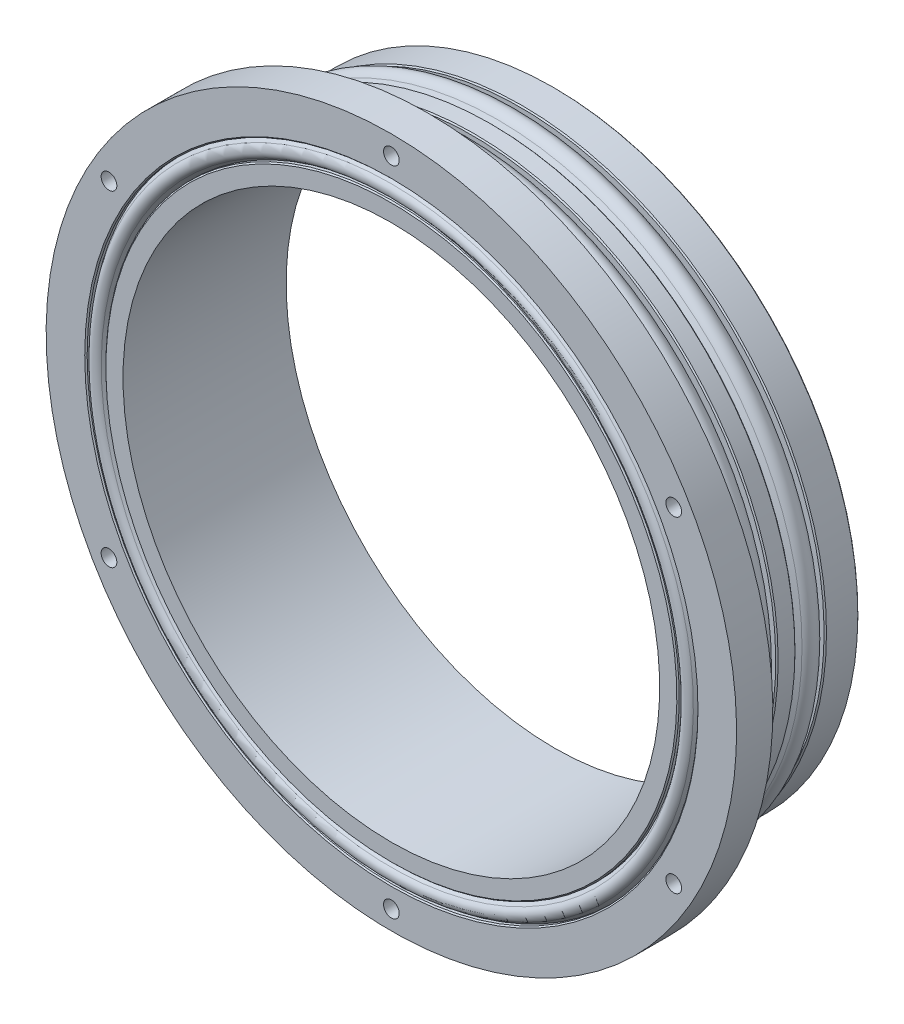
ISO-10303-21;
HEADER;
FILE_DESCRIPTION(('STEP AP214'),'2;1');
FILE_NAME('part.step','',(''),(''),'','','');
FILE_SCHEMA(('AUTOMOTIVE_DESIGN { 1 0 10303 214 1 1 1 1 }'));
ENDSEC;
DATA;
#1=APPLICATION_CONTEXT('core data for automotive mechanical design processes');
#2=APPLICATION_PROTOCOL_DEFINITION('international standard','automotive_design',2000,#1);
#3=PRODUCT_CONTEXT('',#1,'mechanical');
#4=PRODUCT('Part','Part','',(#3));
#5=PRODUCT_RELATED_PRODUCT_CATEGORY('part','',(#4));
#6=PRODUCT_DEFINITION_FORMATION('','',#4);
#7=PRODUCT_DEFINITION_CONTEXT('part definition',#1,'design');
#8=PRODUCT_DEFINITION('design','',#6,#7);
#9=PRODUCT_DEFINITION_SHAPE('','',#8);
#10=(LENGTH_UNIT() NAMED_UNIT(*) SI_UNIT(.MILLI.,.METRE.));
#11=(NAMED_UNIT(*) PLANE_ANGLE_UNIT() SI_UNIT($,.RADIAN.));
#12=(NAMED_UNIT(*) SI_UNIT($,.STERADIAN.) SOLID_ANGLE_UNIT());
#13=UNCERTAINTY_MEASURE_WITH_UNIT(LENGTH_MEASURE(1.E-05),#10,'distance_accuracy_value','');
#14=(GEOMETRIC_REPRESENTATION_CONTEXT(3) GLOBAL_UNCERTAINTY_ASSIGNED_CONTEXT((#13)) GLOBAL_UNIT_ASSIGNED_CONTEXT((#10,
#11,#12)) REPRESENTATION_CONTEXT('',''));
#15=CARTESIAN_POINT('',(0.,0.,0.));
#16=DIRECTION('',(0.,0.,1.));
#17=DIRECTION('',(1.,0.,0.));
#18=AXIS2_PLACEMENT_3D('',#15,#16,#17);
#19=CARTESIAN_POINT('',(0.,44.419,0.));
#20=DIRECTION('',(0.,0.,-1.));
#21=DIRECTION('',(0.,1.,0.));
#22=AXIS2_PLACEMENT_3D('',#19,#20,#21);
#23=PLANE('',#22);
#24=CARTESIAN_POINT('',(0.,-46.99,0.));
#25=DIRECTION('',(0.,0.,-1.));
#26=DIRECTION('',(0.,1.,0.));
#27=AXIS2_PLACEMENT_3D('',#24,#25,#26);
#28=CIRCLE('',#27,1.3);
#29=CARTESIAN_POINT('',(0.,-45.69,0.));
#30=VERTEX_POINT('',#29);
#31=EDGE_CURVE('E186',#30,#30,#28,.T.);
#32=ORIENTED_EDGE('',*,*,#31,.F.);
#33=EDGE_LOOP('',(#32));
#34=FACE_BOUND('',#33,.T.);
#35=CARTESIAN_POINT('',(-46.99,0.,0.));
#36=DIRECTION('',(0.,0.,-1.));
#37=DIRECTION('',(0.,1.,0.));
#38=AXIS2_PLACEMENT_3D('',#35,#36,#37);
#39=CIRCLE('',#38,1.3);
#40=CARTESIAN_POINT('',(-46.99,1.3,0.));
#41=VERTEX_POINT('',#40);
#42=EDGE_CURVE('E180',#41,#41,#39,.T.);
#43=ORIENTED_EDGE('',*,*,#42,.F.);
#44=EDGE_LOOP('',(#43));
#45=FACE_BOUND('',#44,.T.);
#46=CARTESIAN_POINT('',(0.,46.99,0.));
#47=DIRECTION('',(0.,0.,-1.));
#48=DIRECTION('',(0.,1.,0.));
#49=AXIS2_PLACEMENT_3D('',#46,#47,#48);
#50=CIRCLE('',#49,1.3);
#51=CARTESIAN_POINT('',(0.,48.29,0.));
#52=VERTEX_POINT('',#51);
#53=EDGE_CURVE('E174',#52,#52,#50,.T.);
#54=ORIENTED_EDGE('',*,*,#53,.F.);
#55=EDGE_LOOP('',(#54));
#56=FACE_BOUND('',#55,.T.);
#57=CARTESIAN_POINT('',(46.99,0.,0.));
#58=DIRECTION('',(0.,0.,-1.));
#59=DIRECTION('',(0.,1.,0.));
#60=AXIS2_PLACEMENT_3D('',#57,#58,#59);
#61=CIRCLE('',#60,1.3);
#62=CARTESIAN_POINT('',(46.99,1.3,0.));
#63=VERTEX_POINT('',#62);
#64=EDGE_CURVE('E168',#63,#63,#61,.T.);
#65=ORIENTED_EDGE('',*,*,#64,.F.);
#66=EDGE_LOOP('',(#65));
#67=FACE_BOUND('',#66,.T.);
#68=CARTESIAN_POINT('',(0.,0.,0.));
#69=DIRECTION('',(0.,0.,-1.));
#70=DIRECTION('',(0.,1.,0.));
#71=AXIS2_PLACEMENT_3D('',#68,#69,#70);
#72=CIRCLE('',#71,50.219);
#73=CARTESIAN_POINT('',(0.,50.219,0.));
#74=VERTEX_POINT('',#73);
#75=EDGE_CURVE('E65',#74,#74,#72,.T.);
#76=ORIENTED_EDGE('',*,*,#75,.T.);
#77=EDGE_LOOP('',(#76));
#78=FACE_BOUND('',#77,.T.);
#79=CARTESIAN_POINT('',(0.,0.,0.));
#80=DIRECTION('',(0.,0.,-1.));
#81=DIRECTION('',(0.,1.,0.));
#82=AXIS2_PLACEMENT_3D('',#79,#80,#81);
#83=CIRCLE('',#82,44.419);
#84=CARTESIAN_POINT('',(0.,44.419,0.));
#85=VERTEX_POINT('',#84);
#86=EDGE_CURVE('E128',#85,#85,#83,.T.);
#87=ORIENTED_EDGE('',*,*,#86,.F.);
#88=EDGE_LOOP('',(#87));
#89=FACE_BOUND('',#88,.T.);
#90=ADVANCED_FACE('F30',(#34,#45,#56,#67,#78,#89),#23,.T.);
#91=CARTESIAN_POINT('',(0.,0.,0.));
#92=DIRECTION('',(0.,0.,-1.));
#93=DIRECTION('',(0.,1.,0.));
#94=AXIS2_PLACEMENT_3D('',#91,#92,#93);
#95=CYLINDRICAL_SURFACE('',#94,50.419);
#96=CARTESIAN_POINT('',(0.,0.,0.199999999999944));
#97=DIRECTION('',(0.,0.,-1.));
#98=DIRECTION('',(0.,1.,0.));
#99=AXIS2_PLACEMENT_3D('',#96,#97,#98);
#100=CIRCLE('',#99,50.419);
#101=CARTESIAN_POINT('',(0.,50.419,0.199999999999951));
#102=VERTEX_POINT('',#101);
#103=EDGE_CURVE('E59',#102,#102,#100,.F.);
#104=ORIENTED_EDGE('',*,*,#103,.T.);
#105=EDGE_LOOP('',(#104));
#106=FACE_BOUND('',#105,.T.);
#107=CARTESIAN_POINT('',(0.,0.,5.387));
#108=DIRECTION('',(0.,0.,1.));
#109=DIRECTION('',(0.,-1.,0.));
#110=AXIS2_PLACEMENT_3D('',#107,#108,#109);
#111=CIRCLE('',#110,50.419);
#112=CARTESIAN_POINT('',(0.,-50.419,5.38699999999999));
#113=VERTEX_POINT('',#112);
#114=EDGE_CURVE('E62',#113,#113,#111,.F.);
#115=ORIENTED_EDGE('',*,*,#114,.T.);
#116=EDGE_LOOP('',(#115));
#117=FACE_BOUND('',#116,.T.);
#118=ADVANCED_FACE('F203',(#106,#117),#95,.T.);
#119=CARTESIAN_POINT('',(0.,49.04105,5.587));
#120=DIRECTION('',(0.,0.,1.));
#121=DIRECTION('',(0.,-1.,0.));
#122=AXIS2_PLACEMENT_3D('',#119,#120,#121);
#123=PLANE('',#122);
#124=CARTESIAN_POINT('',(0.,0.,5.58699999999999));
#125=DIRECTION('',(0.,0.,1.));
#126=DIRECTION('',(0.,-1.,0.));
#127=AXIS2_PLACEMENT_3D('',#124,#125,#126);
#128=CIRCLE('',#127,50.219);
#129=CARTESIAN_POINT('',(0.,-50.219,5.58699999999999));
#130=VERTEX_POINT('',#129);
#131=EDGE_CURVE('E50',#130,#130,#128,.T.);
#132=ORIENTED_EDGE('',*,*,#131,.T.);
#133=EDGE_LOOP('',(#132));
#134=FACE_BOUND('',#133,.T.);
#135=CARTESIAN_POINT('',(0.,0.,5.58699999999999));
#136=DIRECTION('',(0.,0.,-1.));
#137=DIRECTION('',(0.,1.,0.));
#138=AXIS2_PLACEMENT_3D('',#135,#136,#137);
#139=CIRCLE('',#138,49.04105);
#140=CARTESIAN_POINT('',(0.,49.04105,5.587));
#141=VERTEX_POINT('',#140);
#142=EDGE_CURVE('E80',#141,#141,#139,.T.);
#143=ORIENTED_EDGE('',*,*,#142,.T.);
#144=EDGE_LOOP('',(#143));
#145=FACE_BOUND('',#144,.T.);
#146=ADVANCED_FACE('F303',(#134,#145),#123,.T.);
#147=CARTESIAN_POINT('',(0.,0.,5.58699999999999));
#148=DIRECTION('',(0.,0.,1.));
#149=DIRECTION('',(0.,-1.,0.));
#150=AXIS2_PLACEMENT_3D('',#147,#148,#149);
#151=CONICAL_SURFACE('',#150,49.04105,0.966336052037726);
#152=CARTESIAN_POINT('',(0.,0.,6.54749535514835));
#153=DIRECTION('',(0.,0.,-1.));
#154=DIRECTION('',(0.,1.,0.));
#155=AXIS2_PLACEMENT_3D('',#152,#153,#154);
#156=CIRCLE('',#155,50.431651885961);
#157=CARTESIAN_POINT('',(0.,50.431651885961,6.54749535514836));
#158=VERTEX_POINT('',#157);
#159=EDGE_CURVE('E83',#158,#158,#156,.T.);
#160=ORIENTED_EDGE('',*,*,#159,.T.);
#161=EDGE_LOOP('',(#160));
#162=FACE_BOUND('',#161,.T.);
#163=ORIENTED_EDGE('',*,*,#142,.F.);
#164=EDGE_LOOP('',(#163));
#165=FACE_BOUND('',#164,.T.);
#166=ADVANCED_FACE('F299',(#162,#165),#151,.T.);
#167=CARTESIAN_POINT('',(0.,0.,7.99999999999999));
#168=DIRECTION('',(0.,0.,-1.));
#169=DIRECTION('',(0.,1.,0.));
#170=AXIS2_PLACEMENT_3D('',#167,#168,#169);
#171=TOROIDAL_SURFACE('',#170,49.4284,1.7653);
#172=CARTESIAN_POINT('',(0.,0.,9.45250464485164));
#173=DIRECTION('',(0.,0.,-1.));
#174=DIRECTION('',(0.,1.,0.));
#175=AXIS2_PLACEMENT_3D('',#172,#173,#174);
#176=CIRCLE('',#175,50.431651885961);
#177=CARTESIAN_POINT('',(0.,50.431651885961,9.45250464485164));
#178=VERTEX_POINT('',#177);
#179=EDGE_CURVE('E86',#178,#178,#176,.T.);
#180=ORIENTED_EDGE('',*,*,#179,.T.);
#181=EDGE_LOOP('',(#180));
#182=FACE_BOUND('',#181,.T.);
#183=ORIENTED_EDGE('',*,*,#159,.F.);
#184=EDGE_LOOP('',(#183));
#185=FACE_BOUND('',#184,.T.);
#186=ADVANCED_FACE('F295',(#182,#185),#171,.T.);
#187=CARTESIAN_POINT('',(0.,0.,9.45250464485164));
#188=DIRECTION('',(0.,0.,-1.));
#189=DIRECTION('',(0.,1.,0.));
#190=AXIS2_PLACEMENT_3D('',#187,#188,#189);
#191=CONICAL_SURFACE('',#190,50.431651885961,0.966336052037726);
#192=CARTESIAN_POINT('',(0.,0.,10.413));
#193=DIRECTION('',(0.,0.,-1.));
#194=DIRECTION('',(0.,1.,0.));
#195=AXIS2_PLACEMENT_3D('',#192,#193,#194);
#196=CIRCLE('',#195,49.04105);
#197=CARTESIAN_POINT('',(0.,49.04105,10.413));
#198=VERTEX_POINT('',#197);
#199=EDGE_CURVE('E89',#198,#198,#196,.T.);
#200=ORIENTED_EDGE('',*,*,#199,.T.);
#201=EDGE_LOOP('',(#200));
#202=FACE_BOUND('',#201,.T.);
#203=ORIENTED_EDGE('',*,*,#179,.F.);
#204=EDGE_LOOP('',(#203));
#205=FACE_BOUND('',#204,.T.);
#206=ADVANCED_FACE('F291',(#202,#205),#191,.T.);
#207=CARTESIAN_POINT('',(0.,50.419,10.413));
#208=DIRECTION('',(0.,0.,-1.));
#209=DIRECTION('',(0.,1.,0.));
#210=AXIS2_PLACEMENT_3D('',#207,#208,#209);
#211=PLANE('',#210);
#212=CARTESIAN_POINT('',(0.,0.,10.413));
#213=DIRECTION('',(0.,0.,-1.));
#214=DIRECTION('',(0.,1.,0.));
#215=AXIS2_PLACEMENT_3D('',#212,#213,#214);
#216=CIRCLE('',#215,50.219);
#217=CARTESIAN_POINT('',(0.,50.219,10.413));
#218=VERTEX_POINT('',#217);
#219=EDGE_CURVE('E45',#218,#218,#216,.T.);
#220=ORIENTED_EDGE('',*,*,#219,.T.);
#221=EDGE_LOOP('',(#220));
#222=FACE_BOUND('',#221,.T.);
#223=ORIENTED_EDGE('',*,*,#199,.F.);
#224=EDGE_LOOP('',(#223));
#225=FACE_BOUND('',#224,.T.);
#226=ADVANCED_FACE('F288',(#222,#225),#211,.T.);
#227=CARTESIAN_POINT('',(0.,0.,0.));
#228=DIRECTION('',(0.,0.,-1.));
#229=DIRECTION('',(0.,1.,0.));
#230=AXIS2_PLACEMENT_3D('',#227,#228,#229);
#231=CYLINDRICAL_SURFACE('',#230,50.419);
#232=CARTESIAN_POINT('',(0.,0.,10.613));
#233=DIRECTION('',(0.,0.,-1.));
#234=DIRECTION('',(0.,1.,0.));
#235=AXIS2_PLACEMENT_3D('',#232,#233,#234);
#236=CIRCLE('',#235,50.419);
#237=CARTESIAN_POINT('',(0.,50.419,10.613));
#238=VERTEX_POINT('',#237);
#239=EDGE_CURVE('E37',#238,#238,#236,.F.);
#240=ORIENTED_EDGE('',*,*,#239,.T.);
#241=EDGE_LOOP('',(#240));
#242=FACE_BOUND('',#241,.T.);
#243=CARTESIAN_POINT('',(0.,0.,13.387));
#244=DIRECTION('',(0.,0.,1.));
#245=DIRECTION('',(0.,-1.,0.));
#246=AXIS2_PLACEMENT_3D('',#243,#244,#245);
#247=CIRCLE('',#246,50.419);
#248=CARTESIAN_POINT('',(0.,-50.419,13.387));
#249=VERTEX_POINT('',#248);
#250=EDGE_CURVE('E41',#249,#249,#247,.F.);
#251=ORIENTED_EDGE('',*,*,#250,.T.);
#252=EDGE_LOOP('',(#251));
#253=FACE_BOUND('',#252,.T.);
#254=ADVANCED_FACE('F285',(#242,#253),#231,.T.);
#255=CARTESIAN_POINT('',(0.,49.04105,13.587));
#256=DIRECTION('',(0.,0.,1.));
#257=DIRECTION('',(0.,-1.,0.));
#258=AXIS2_PLACEMENT_3D('',#255,#256,#257);
#259=PLANE('',#258);
#260=CARTESIAN_POINT('',(0.,0.,13.587));
#261=DIRECTION('',(0.,0.,1.));
#262=DIRECTION('',(0.,-1.,0.));
#263=AXIS2_PLACEMENT_3D('',#260,#261,#262);
#264=CIRCLE('',#263,50.219);
#265=CARTESIAN_POINT('',(0.,-50.219,13.587));
#266=VERTEX_POINT('',#265);
#267=EDGE_CURVE('E10',#266,#266,#264,.T.);
#268=ORIENTED_EDGE('',*,*,#267,.T.);
#269=EDGE_LOOP('',(#268));
#270=FACE_BOUND('',#269,.T.);
#271=CARTESIAN_POINT('',(0.,0.,13.587));
#272=DIRECTION('',(0.,0.,-1.));
#273=DIRECTION('',(0.,1.,0.));
#274=AXIS2_PLACEMENT_3D('',#271,#272,#273);
#275=CIRCLE('',#274,49.04105);
#276=CARTESIAN_POINT('',(0.,49.04105,13.587));
#277=VERTEX_POINT('',#276);
#278=EDGE_CURVE('E92',#277,#277,#275,.T.);
#279=ORIENTED_EDGE('',*,*,#278,.T.);
#280=EDGE_LOOP('',(#279));
#281=FACE_BOUND('',#280,.T.);
#282=ADVANCED_FACE('F281',(#270,#281),#259,.T.);
#283=CARTESIAN_POINT('',(0.,0.,13.587));
#284=DIRECTION('',(0.,0.,1.));
#285=DIRECTION('',(0.,-1.,0.));
#286=AXIS2_PLACEMENT_3D('',#283,#284,#285);
#287=CONICAL_SURFACE('',#286,49.04105,0.966336052037727);
#288=CARTESIAN_POINT('',(0.,0.,14.5474953551484));
#289=DIRECTION('',(0.,0.,-1.));
#290=DIRECTION('',(0.,1.,0.));
#291=AXIS2_PLACEMENT_3D('',#288,#289,#290);
#292=CIRCLE('',#291,50.431651885961);
#293=CARTESIAN_POINT('',(0.,50.431651885961,14.5474953551484));
#294=VERTEX_POINT('',#293);
#295=EDGE_CURVE('E95',#294,#294,#292,.T.);
#296=ORIENTED_EDGE('',*,*,#295,.T.);
#297=EDGE_LOOP('',(#296));
#298=FACE_BOUND('',#297,.T.);
#299=ORIENTED_EDGE('',*,*,#278,.F.);
#300=EDGE_LOOP('',(#299));
#301=FACE_BOUND('',#300,.T.);
#302=ADVANCED_FACE('F277',(#298,#301),#287,.T.);
#303=CARTESIAN_POINT('',(0.,0.,16.));
#304=DIRECTION('',(0.,0.,-1.));
#305=DIRECTION('',(0.,1.,0.));
#306=AXIS2_PLACEMENT_3D('',#303,#304,#305);
#307=TOROIDAL_SURFACE('',#306,49.4284,1.7653);
#308=CARTESIAN_POINT('',(0.,0.,17.4525046448516));
#309=DIRECTION('',(0.,0.,-1.));
#310=DIRECTION('',(0.,1.,0.));
#311=AXIS2_PLACEMENT_3D('',#308,#309,#310);
#312=CIRCLE('',#311,50.431651885961);
#313=CARTESIAN_POINT('',(0.,50.431651885961,17.4525046448516));
#314=VERTEX_POINT('',#313);
#315=EDGE_CURVE('E98',#314,#314,#312,.T.);
#316=ORIENTED_EDGE('',*,*,#315,.T.);
#317=EDGE_LOOP('',(#316));
#318=FACE_BOUND('',#317,.T.);
#319=ORIENTED_EDGE('',*,*,#295,.F.);
#320=EDGE_LOOP('',(#319));
#321=FACE_BOUND('',#320,.T.);
#322=ADVANCED_FACE('F273',(#318,#321),#307,.T.);
#323=CARTESIAN_POINT('',(0.,0.,17.4525046448516));
#324=DIRECTION('',(0.,0.,-1.));
#325=DIRECTION('',(0.,1.,0.));
#326=AXIS2_PLACEMENT_3D('',#323,#324,#325);
#327=CONICAL_SURFACE('',#326,50.431651885961,0.966336052037724);
#328=CARTESIAN_POINT('',(0.,0.,18.413));
#329=DIRECTION('',(0.,0.,-1.));
#330=DIRECTION('',(0.,1.,0.));
#331=AXIS2_PLACEMENT_3D('',#328,#329,#330);
#332=CIRCLE('',#331,49.04105);
#333=CARTESIAN_POINT('',(0.,49.04105,18.413));
#334=VERTEX_POINT('',#333);
#335=EDGE_CURVE('E101',#334,#334,#332,.T.);
#336=ORIENTED_EDGE('',*,*,#335,.T.);
#337=EDGE_LOOP('',(#336));
#338=FACE_BOUND('',#337,.T.);
#339=ORIENTED_EDGE('',*,*,#315,.F.);
#340=EDGE_LOOP('',(#339));
#341=FACE_BOUND('',#340,.T.);
#342=ADVANCED_FACE('F269',(#338,#341),#327,.T.);
#343=CARTESIAN_POINT('',(0.,50.419,18.413));
#344=DIRECTION('',(0.,0.,-1.));
#345=DIRECTION('',(0.,1.,0.));
#346=AXIS2_PLACEMENT_3D('',#343,#344,#345);
#347=PLANE('',#346);
#348=CARTESIAN_POINT('',(0.,0.,18.413));
#349=DIRECTION('',(0.,0.,-1.));
#350=DIRECTION('',(0.,1.,0.));
#351=AXIS2_PLACEMENT_3D('',#348,#349,#350);
#352=CIRCLE('',#351,50.219);
#353=CARTESIAN_POINT('',(0.,50.219,18.413));
#354=VERTEX_POINT('',#353);
#355=EDGE_CURVE('E56',#354,#354,#352,.T.);
#356=ORIENTED_EDGE('',*,*,#355,.T.);
#357=EDGE_LOOP('',(#356));
#358=FACE_BOUND('',#357,.T.);
#359=ORIENTED_EDGE('',*,*,#335,.F.);
#360=EDGE_LOOP('',(#359));
#361=FACE_BOUND('',#360,.T.);
#362=ADVANCED_FACE('F265',(#358,#361),#347,.T.);
#363=CARTESIAN_POINT('',(0.,0.,0.));
#364=DIRECTION('',(0.,0.,-1.));
#365=DIRECTION('',(0.,1.,0.));
#366=AXIS2_PLACEMENT_3D('',#363,#364,#365);
#367=CYLINDRICAL_SURFACE('',#366,50.419);
#368=CARTESIAN_POINT('',(0.,0.,18.613));
#369=DIRECTION('',(0.,0.,-1.));
#370=DIRECTION('',(0.,1.,0.));
#371=AXIS2_PLACEMENT_3D('',#368,#369,#370);
#372=CIRCLE('',#371,50.419);
#373=CARTESIAN_POINT('',(0.,50.419,18.613));
#374=VERTEX_POINT('',#373);
#375=EDGE_CURVE('E53',#374,#374,#372,.F.);
#376=ORIENTED_EDGE('',*,*,#375,.T.);
#377=EDGE_LOOP('',(#376));
#378=FACE_BOUND('',#377,.T.);
#379=CARTESIAN_POINT('',(0.,0.,21.));
#380=DIRECTION('',(0.,0.,-1.));
#381=DIRECTION('',(0.,1.,0.));
#382=AXIS2_PLACEMENT_3D('',#379,#380,#381);
#383=CIRCLE('',#382,50.419);
#384=CARTESIAN_POINT('',(0.,50.419,21.));
#385=VERTEX_POINT('',#384);
#386=EDGE_CURVE('E104',#385,#385,#383,.T.);
#387=ORIENTED_EDGE('',*,*,#386,.T.);
#388=EDGE_LOOP('',(#387));
#389=FACE_BOUND('',#388,.T.);
#390=ADVANCED_FACE('F261',(#378,#389),#367,.T.);
#391=CARTESIAN_POINT('',(0.,50.419,21.));
#392=DIRECTION('',(0.,0.,-1.));
#393=DIRECTION('',(0.,1.,0.));
#394=AXIS2_PLACEMENT_3D('',#391,#392,#393);
#395=PLANE('',#394);
#396=CARTESIAN_POINT('',(-46.7437211692651,26.9875,21.));
#397=DIRECTION('',(0.,0.,-1.));
#398=DIRECTION('',(0.,1.,0.));
#399=AXIS2_PLACEMENT_3D('',#396,#397,#398);
#400=CIRCLE('',#399,1.3);
#401=CARTESIAN_POINT('',(-46.7437211692651,28.2875,21.));
#402=VERTEX_POINT('',#401);
#403=EDGE_CURVE('E161',#402,#402,#400,.F.);
#404=ORIENTED_EDGE('',*,*,#403,.T.);
#405=EDGE_LOOP('',(#404));
#406=FACE_BOUND('',#405,.T.);
#407=CARTESIAN_POINT('',(-46.7437211692651,-26.9875,21.));
#408=DIRECTION('',(0.,0.,-1.));
#409=DIRECTION('',(0.,1.,0.));
#410=AXIS2_PLACEMENT_3D('',#407,#408,#409);
#411=CIRCLE('',#410,1.3);
#412=CARTESIAN_POINT('',(-46.7437211692651,-25.6875,21.));
#413=VERTEX_POINT('',#412);
#414=EDGE_CURVE('E155',#413,#413,#411,.F.);
#415=ORIENTED_EDGE('',*,*,#414,.T.);
#416=EDGE_LOOP('',(#415));
#417=FACE_BOUND('',#416,.T.);
#418=CARTESIAN_POINT('',(0.,-53.975,21.));
#419=DIRECTION('',(0.,0.,-1.));
#420=DIRECTION('',(0.,1.,0.));
#421=AXIS2_PLACEMENT_3D('',#418,#419,#420);
#422=CIRCLE('',#421,1.3);
#423=CARTESIAN_POINT('',(0.,-52.675,21.));
#424=VERTEX_POINT('',#423);
#425=EDGE_CURVE('E149',#424,#424,#422,.F.);
#426=ORIENTED_EDGE('',*,*,#425,.T.);
#427=EDGE_LOOP('',(#426));
#428=FACE_BOUND('',#427,.T.);
#429=CARTESIAN_POINT('',(46.7437211692651,-26.9875,21.));
#430=DIRECTION('',(0.,0.,-1.));
#431=DIRECTION('',(0.,1.,0.));
#432=AXIS2_PLACEMENT_3D('',#429,#430,#431);
#433=CIRCLE('',#432,1.3);
#434=CARTESIAN_POINT('',(46.7437211692651,-25.6875,21.));
#435=VERTEX_POINT('',#434);
#436=EDGE_CURVE('E143',#435,#435,#433,.F.);
#437=ORIENTED_EDGE('',*,*,#436,.T.);
#438=EDGE_LOOP('',(#437));
#439=FACE_BOUND('',#438,.T.);
#440=CARTESIAN_POINT('',(46.7437211692651,26.9875,21.));
#441=DIRECTION('',(0.,0.,-1.));
#442=DIRECTION('',(0.,1.,0.));
#443=AXIS2_PLACEMENT_3D('',#440,#441,#442);
#444=CIRCLE('',#443,1.3);
#445=CARTESIAN_POINT('',(46.7437211692651,28.2875,21.));
#446=VERTEX_POINT('',#445);
#447=EDGE_CURVE('E137',#446,#446,#444,.F.);
#448=ORIENTED_EDGE('',*,*,#447,.T.);
#449=EDGE_LOOP('',(#448));
#450=FACE_BOUND('',#449,.T.);
#451=CARTESIAN_POINT('',(0.,53.975,21.));
#452=DIRECTION('',(0.,0.,-1.));
#453=DIRECTION('',(0.,1.,0.));
#454=AXIS2_PLACEMENT_3D('',#451,#452,#453);
#455=CIRCLE('',#454,1.3);
#456=CARTESIAN_POINT('',(0.,55.275,21.));
#457=VERTEX_POINT('',#456);
#458=EDGE_CURVE('E131',#457,#457,#455,.F.);
#459=ORIENTED_EDGE('',*,*,#458,.T.);
#460=EDGE_LOOP('',(#459));
#461=FACE_BOUND('',#460,.T.);
#462=CARTESIAN_POINT('',(0.,0.,21.));
#463=DIRECTION('',(0.,0.,-1.));
#464=DIRECTION('',(0.,1.,0.));
#465=AXIS2_PLACEMENT_3D('',#462,#463,#464);
#466=CIRCLE('',#465,57.15);
#467=CARTESIAN_POINT('',(0.,57.15,21.));
#468=VERTEX_POINT('',#467);
#469=EDGE_CURVE('E107',#468,#468,#466,.T.);
#470=ORIENTED_EDGE('',*,*,#469,.T.);
#471=EDGE_LOOP('',(#470));
#472=FACE_BOUND('',#471,.T.);
#473=ORIENTED_EDGE('',*,*,#386,.F.);
#474=EDGE_LOOP('',(#473));
#475=FACE_BOUND('',#474,.T.);
#476=ADVANCED_FACE('F257',(#406,#417,#428,#439,#450,#461,#472,#475),#395,.T.);
#477=CARTESIAN_POINT('',(0.,0.,0.));
#478=DIRECTION('',(0.,0.,-1.));
#479=DIRECTION('',(0.,1.,0.));
#480=AXIS2_PLACEMENT_3D('',#477,#478,#479);
#481=CYLINDRICAL_SURFACE('',#480,57.15);
#482=CARTESIAN_POINT('',(0.,0.,27.));
#483=DIRECTION('',(0.,0.,-1.));
#484=DIRECTION('',(0.,1.,0.));
#485=AXIS2_PLACEMENT_3D('',#482,#483,#484);
#486=CIRCLE('',#485,57.15);
#487=CARTESIAN_POINT('',(0.,57.15,27.));
#488=VERTEX_POINT('',#487);
#489=EDGE_CURVE('E110',#488,#488,#486,.T.);
#490=ORIENTED_EDGE('',*,*,#489,.T.);
#491=EDGE_LOOP('',(#490));
#492=FACE_BOUND('',#491,.T.);
#493=ORIENTED_EDGE('',*,*,#469,.F.);
#494=EDGE_LOOP('',(#493));
#495=FACE_BOUND('',#494,.T.);
#496=ADVANCED_FACE('F253',(#492,#495),#481,.T.);
#497=CARTESIAN_POINT('',(0.,57.15,27.));
#498=DIRECTION('',(0.,0.,1.));
#499=DIRECTION('',(0.,-1.,0.));
#500=AXIS2_PLACEMENT_3D('',#497,#498,#499);
#501=PLANE('',#500);
#502=CARTESIAN_POINT('',(0.,0.,27.));
#503=DIRECTION('',(0.,0.,1.));
#504=DIRECTION('',(0.,-1.,0.));
#505=AXIS2_PLACEMENT_3D('',#502,#503,#504);
#506=CIRCLE('',#505,50.7587);
#507=CARTESIAN_POINT('',(0.,-50.7587,27.));
#508=VERTEX_POINT('',#507);
#509=EDGE_CURVE('E77',#508,#508,#506,.F.);
#510=ORIENTED_EDGE('',*,*,#509,.T.);
#511=EDGE_LOOP('',(#510));
#512=FACE_BOUND('',#511,.T.);
#513=CARTESIAN_POINT('',(-46.7437211692651,26.9875,27.));
#514=DIRECTION('',(0.,0.,1.));
#515=DIRECTION('',(1.,0.,0.));
#516=AXIS2_PLACEMENT_3D('',#513,#514,#515);
#517=CIRCLE('',#516,1.3);
#518=CARTESIAN_POINT('',(-45.4437211692651,26.9875,27.));
#519=VERTEX_POINT('',#518);
#520=EDGE_CURVE('E164',#519,#519,#517,.T.);
#521=ORIENTED_EDGE('',*,*,#520,.F.);
#522=EDGE_LOOP('',(#521));
#523=FACE_BOUND('',#522,.T.);
#524=CARTESIAN_POINT('',(-46.7437211692651,-26.9875,27.));
#525=DIRECTION('',(0.,0.,1.));
#526=DIRECTION('',(1.,0.,0.));
#527=AXIS2_PLACEMENT_3D('',#524,#525,#526);
#528=CIRCLE('',#527,1.3);
#529=CARTESIAN_POINT('',(-45.4437211692651,-26.9875,27.));
#530=VERTEX_POINT('',#529);
#531=EDGE_CURVE('E158',#530,#530,#528,.T.);
#532=ORIENTED_EDGE('',*,*,#531,.F.);
#533=EDGE_LOOP('',(#532));
#534=FACE_BOUND('',#533,.T.);
#535=CARTESIAN_POINT('',(0.,-53.975,27.));
#536=DIRECTION('',(0.,0.,1.));
#537=DIRECTION('',(1.,0.,0.));
#538=AXIS2_PLACEMENT_3D('',#535,#536,#537);
#539=CIRCLE('',#538,1.3);
#540=CARTESIAN_POINT('',(1.30000000000001,-53.975,27.));
#541=VERTEX_POINT('',#540);
#542=EDGE_CURVE('E152',#541,#541,#539,.T.);
#543=ORIENTED_EDGE('',*,*,#542,.F.);
#544=EDGE_LOOP('',(#543));
#545=FACE_BOUND('',#544,.T.);
#546=CARTESIAN_POINT('',(46.7437211692651,-26.9875,27.));
#547=DIRECTION('',(0.,0.,1.));
#548=DIRECTION('',(1.,0.,0.));
#549=AXIS2_PLACEMENT_3D('',#546,#547,#548);
#550=CIRCLE('',#549,1.3);
#551=CARTESIAN_POINT('',(48.0437211692651,-26.9875,27.));
#552=VERTEX_POINT('',#551);
#553=EDGE_CURVE('E146',#552,#552,#550,.T.);
#554=ORIENTED_EDGE('',*,*,#553,.F.);
#555=EDGE_LOOP('',(#554));
#556=FACE_BOUND('',#555,.T.);
#557=CARTESIAN_POINT('',(46.7437211692651,26.9875,27.));
#558=DIRECTION('',(0.,0.,1.));
#559=DIRECTION('',(1.,0.,0.));
#560=AXIS2_PLACEMENT_3D('',#557,#558,#559);
#561=CIRCLE('',#560,1.3);
#562=CARTESIAN_POINT('',(48.0437211692651,26.9875,27.));
#563=VERTEX_POINT('',#562);
#564=EDGE_CURVE('E140',#563,#563,#561,.T.);
#565=ORIENTED_EDGE('',*,*,#564,.F.);
#566=EDGE_LOOP('',(#565));
#567=FACE_BOUND('',#566,.T.);
#568=CARTESIAN_POINT('',(0.,53.975,27.));
#569=DIRECTION('',(0.,0.,1.));
#570=DIRECTION('',(1.,0.,0.));
#571=AXIS2_PLACEMENT_3D('',#568,#569,#570);
#572=CIRCLE('',#571,1.3);
#573=CARTESIAN_POINT('',(1.3,53.975,27.));
#574=VERTEX_POINT('',#573);
#575=EDGE_CURVE('E134',#574,#574,#572,.T.);
#576=ORIENTED_EDGE('',*,*,#575,.F.);
#577=EDGE_LOOP('',(#576));
#578=FACE_BOUND('',#577,.T.);
#579=ORIENTED_EDGE('',*,*,#489,.F.);
#580=EDGE_LOOP('',(#579));
#581=FACE_BOUND('',#580,.T.);
#582=ADVANCED_FACE('F249',(#512,#523,#534,#545,#556,#567,#578,#581),#501,.T.);
#583=CARTESIAN_POINT('',(0.,0.,0.));
#584=DIRECTION('',(0.,0.,-1.));
#585=DIRECTION('',(0.,1.,0.));
#586=AXIS2_PLACEMENT_3D('',#583,#584,#585);
#587=CYLINDRICAL_SURFACE('',#586,50.5587);
#588=CARTESIAN_POINT('',(0.,0.,26.8));
#589=DIRECTION('',(0.,0.,1.));
#590=DIRECTION('',(0.,-1.,0.));
#591=AXIS2_PLACEMENT_3D('',#588,#589,#590);
#592=CIRCLE('',#591,50.5587);
#593=CARTESIAN_POINT('',(0.,-50.5587,26.8));
#594=VERTEX_POINT('',#593);
#595=EDGE_CURVE('E74',#594,#594,#592,.T.);
#596=ORIENTED_EDGE('',*,*,#595,.T.);
#597=EDGE_LOOP('',(#596));
#598=FACE_BOUND('',#597,.T.);
#599=CARTESIAN_POINT('',(0.,0.,26.2791702351356));
#600=DIRECTION('',(0.,0.,-1.));
#601=DIRECTION('',(0.,1.,0.));
#602=AXIS2_PLACEMENT_3D('',#599,#600,#601);
#603=CIRCLE('',#602,50.5587);
#604=CARTESIAN_POINT('',(0.,50.5587,26.2791702351356));
#605=VERTEX_POINT('',#604);
#606=EDGE_CURVE('E113',#605,#605,#603,.T.);
#607=ORIENTED_EDGE('',*,*,#606,.T.);
#608=EDGE_LOOP('',(#607));
#609=FACE_BOUND('',#608,.T.);
#610=ADVANCED_FACE('F245',(#598,#609),#587,.F.);
#611=CARTESIAN_POINT('',(0.,0.,26.2791702351356));
#612=DIRECTION('',(0.,0.,-1.));
#613=DIRECTION('',(0.,1.,0.));
#614=AXIS2_PLACEMENT_3D('',#611,#612,#613);
#615=CONICAL_SURFACE('',#614,50.5587,0.634842696572141);
#616=CARTESIAN_POINT('',(0.,0.,27.0190146200091));
#617=DIRECTION('',(0.,0.,-1.));
#618=DIRECTION('',(0.,1.,0.));
#619=AXIS2_PLACEMENT_3D('',#616,#617,#618);
#620=CIRCLE('',#619,50.0137615637377);
#621=CARTESIAN_POINT('',(0.,50.0137615637377,27.0190146200091));
#622=VERTEX_POINT('',#621);
#623=EDGE_CURVE('E116',#622,#622,#620,.T.);
#624=ORIENTED_EDGE('',*,*,#623,.T.);
#625=EDGE_LOOP('',(#624));
#626=FACE_BOUND('',#625,.T.);
#627=ORIENTED_EDGE('',*,*,#606,.F.);
#628=EDGE_LOOP('',(#627));
#629=FACE_BOUND('',#628,.T.);
#630=ADVANCED_FACE('F241',(#626,#629),#615,.T.);
#631=CARTESIAN_POINT('',(0.,0.,26.2791702351356));
#632=DIRECTION('',(0.,0.,-1.));
#633=DIRECTION('',(0.,1.,0.));
#634=AXIS2_PLACEMENT_3D('',#631,#632,#633);
#635=TOROIDAL_SURFACE('',#634,49.0093,1.24752264382461);
#636=CARTESIAN_POINT('',(0.,0.,27.0190146200091));
#637=DIRECTION('',(0.,0.,-1.));
#638=DIRECTION('',(0.,1.,0.));
#639=AXIS2_PLACEMENT_3D('',#636,#637,#638);
#640=CIRCLE('',#639,48.0048384362623);
#641=CARTESIAN_POINT('',(0.,48.0048384362623,27.0190146200091));
#642=VERTEX_POINT('',#641);
#643=EDGE_CURVE('E119',#642,#642,#640,.T.);
#644=ORIENTED_EDGE('',*,*,#643,.T.);
#645=EDGE_LOOP('',(#644));
#646=FACE_BOUND('',#645,.T.);
#647=ORIENTED_EDGE('',*,*,#623,.F.);
#648=EDGE_LOOP('',(#647));
#649=FACE_BOUND('',#648,.T.);
#650=ADVANCED_FACE('F237',(#646,#649),#635,.T.);
#651=CARTESIAN_POINT('',(0.,0.,27.0190146200091));
#652=DIRECTION('',(0.,0.,1.));
#653=DIRECTION('',(0.,-1.,0.));
#654=AXIS2_PLACEMENT_3D('',#651,#652,#653);
#655=CONICAL_SURFACE('',#654,48.0048384362623,0.634842696572118);
#656=CARTESIAN_POINT('',(0.,0.,26.2791702351356));
#657=DIRECTION('',(0.,0.,-1.));
#658=DIRECTION('',(0.,1.,0.));
#659=AXIS2_PLACEMENT_3D('',#656,#657,#658);
#660=CIRCLE('',#659,47.4599);
#661=CARTESIAN_POINT('',(0.,47.4599,26.2791702351356));
#662=VERTEX_POINT('',#661);
#663=EDGE_CURVE('E122',#662,#662,#660,.T.);
#664=ORIENTED_EDGE('',*,*,#663,.T.);
#665=EDGE_LOOP('',(#664));
#666=FACE_BOUND('',#665,.T.);
#667=ORIENTED_EDGE('',*,*,#643,.F.);
#668=EDGE_LOOP('',(#667));
#669=FACE_BOUND('',#668,.T.);
#670=ADVANCED_FACE('F230',(#666,#669),#655,.F.);
#671=CARTESIAN_POINT('',(0.,0.,0.));
#672=DIRECTION('',(0.,0.,-1.));
#673=DIRECTION('',(0.,1.,0.));
#674=AXIS2_PLACEMENT_3D('',#671,#672,#673);
#675=CYLINDRICAL_SURFACE('',#674,47.4599);
#676=CARTESIAN_POINT('',(0.,0.,26.8));
#677=DIRECTION('',(0.,0.,1.));
#678=DIRECTION('',(0.,-1.,0.));
#679=AXIS2_PLACEMENT_3D('',#676,#677,#678);
#680=CIRCLE('',#679,47.4599);
#681=CARTESIAN_POINT('',(0.,-47.4599,26.8));
#682=VERTEX_POINT('',#681);
#683=EDGE_CURVE('E71',#682,#682,#680,.F.);
#684=ORIENTED_EDGE('',*,*,#683,.T.);
#685=EDGE_LOOP('',(#684));
#686=FACE_BOUND('',#685,.T.);
#687=ORIENTED_EDGE('',*,*,#663,.F.);
#688=EDGE_LOOP('',(#687));
#689=FACE_BOUND('',#688,.T.);
#690=ADVANCED_FACE('F224',(#686,#689),#675,.T.);
#691=CARTESIAN_POINT('',(0.,47.4599,27.));
#692=DIRECTION('',(0.,0.,1.));
#693=DIRECTION('',(0.,-1.,0.));
#694=AXIS2_PLACEMENT_3D('',#691,#692,#693);
#695=PLANE('',#694);
#696=CARTESIAN_POINT('',(0.,0.,27.));
#697=DIRECTION('',(0.,0.,1.));
#698=DIRECTION('',(0.,-1.,0.));
#699=AXIS2_PLACEMENT_3D('',#696,#697,#698);
#700=CIRCLE('',#699,47.2599);
#701=CARTESIAN_POINT('',(0.,-47.2599,27.));
#702=VERTEX_POINT('',#701);
#703=EDGE_CURVE('E68',#702,#702,#700,.T.);
#704=ORIENTED_EDGE('',*,*,#703,.T.);
#705=EDGE_LOOP('',(#704));
#706=FACE_BOUND('',#705,.T.);
#707=CARTESIAN_POINT('',(0.,0.,27.));
#708=DIRECTION('',(0.,0.,-1.));
#709=DIRECTION('',(0.,1.,0.));
#710=AXIS2_PLACEMENT_3D('',#707,#708,#709);
#711=CIRCLE('',#710,44.419);
#712=CARTESIAN_POINT('',(0.,44.419,27.));
#713=VERTEX_POINT('',#712);
#714=EDGE_CURVE('E125',#713,#713,#711,.T.);
#715=ORIENTED_EDGE('',*,*,#714,.T.);
#716=EDGE_LOOP('',(#715));
#717=FACE_BOUND('',#716,.T.);
#718=ADVANCED_FACE('F219',(#706,#717),#695,.T.);
#719=CARTESIAN_POINT('',(0.,0.,0.));
#720=DIRECTION('',(0.,0.,-1.));
#721=DIRECTION('',(0.,1.,0.));
#722=AXIS2_PLACEMENT_3D('',#719,#720,#721);
#723=CYLINDRICAL_SURFACE('',#722,44.419);
#724=ORIENTED_EDGE('',*,*,#86,.T.);
#725=EDGE_LOOP('',(#724));
#726=FACE_BOUND('',#725,.T.);
#727=ORIENTED_EDGE('',*,*,#714,.F.);
#728=EDGE_LOOP('',(#727));
#729=FACE_BOUND('',#728,.T.);
#730=ADVANCED_FACE('F215',(#726,#729),#723,.F.);
#731=CARTESIAN_POINT('',(0.,53.975,17.3230447378299));
#732=DIRECTION('',(0.,0.,1.));
#733=DIRECTION('',(1.,0.,0.));
#734=AXIS2_PLACEMENT_3D('',#731,#732,#733);
#735=CYLINDRICAL_SURFACE('',#734,1.3);
#736=ORIENTED_EDGE('',*,*,#575,.T.);
#737=EDGE_LOOP('',(#736));
#738=FACE_BOUND('',#737,.T.);
#739=ORIENTED_EDGE('',*,*,#458,.F.);
#740=EDGE_LOOP('',(#739));
#741=FACE_BOUND('',#740,.T.);
#742=ADVANCED_FACE('F218',(#738,#741),#735,.F.);
#743=CARTESIAN_POINT('',(46.7437211692651,26.9875,17.3230447378299));
#744=DIRECTION('',(0.,0.,1.));
#745=DIRECTION('',(1.,0.,0.));
#746=AXIS2_PLACEMENT_3D('',#743,#744,#745);
#747=CYLINDRICAL_SURFACE('',#746,1.3);
#748=ORIENTED_EDGE('',*,*,#564,.T.);
#749=EDGE_LOOP('',(#748));
#750=FACE_BOUND('',#749,.T.);
#751=ORIENTED_EDGE('',*,*,#447,.F.);
#752=EDGE_LOOP('',(#751));
#753=FACE_BOUND('',#752,.T.);
#754=ADVANCED_FACE('F383',(#750,#753),#747,.F.);
#755=CARTESIAN_POINT('',(46.7437211692651,-26.9875,17.3230447378299));
#756=DIRECTION('',(0.,0.,1.));
#757=DIRECTION('',(1.,0.,0.));
#758=AXIS2_PLACEMENT_3D('',#755,#756,#757);
#759=CYLINDRICAL_SURFACE('',#758,1.3);
#760=ORIENTED_EDGE('',*,*,#553,.T.);
#761=EDGE_LOOP('',(#760));
#762=FACE_BOUND('',#761,.T.);
#763=ORIENTED_EDGE('',*,*,#436,.F.);
#764=EDGE_LOOP('',(#763));
#765=FACE_BOUND('',#764,.T.);
#766=ADVANCED_FACE('F379',(#762,#765),#759,.F.);
#767=CARTESIAN_POINT('',(0.,-53.975,17.3230447378299));
#768=DIRECTION('',(0.,0.,1.));
#769=DIRECTION('',(1.,0.,0.));
#770=AXIS2_PLACEMENT_3D('',#767,#768,#769);
#771=CYLINDRICAL_SURFACE('',#770,1.3);
#772=ORIENTED_EDGE('',*,*,#542,.T.);
#773=EDGE_LOOP('',(#772));
#774=FACE_BOUND('',#773,.T.);
#775=ORIENTED_EDGE('',*,*,#425,.F.);
#776=EDGE_LOOP('',(#775));
#777=FACE_BOUND('',#776,.T.);
#778=ADVANCED_FACE('F375',(#774,#777),#771,.F.);
#779=CARTESIAN_POINT('',(-46.7437211692651,-26.9875,17.3230447378299));
#780=DIRECTION('',(0.,0.,1.));
#781=DIRECTION('',(1.,0.,0.));
#782=AXIS2_PLACEMENT_3D('',#779,#780,#781);
#783=CYLINDRICAL_SURFACE('',#782,1.3);
#784=ORIENTED_EDGE('',*,*,#531,.T.);
#785=EDGE_LOOP('',(#784));
#786=FACE_BOUND('',#785,.T.);
#787=ORIENTED_EDGE('',*,*,#414,.F.);
#788=EDGE_LOOP('',(#787));
#789=FACE_BOUND('',#788,.T.);
#790=ADVANCED_FACE('F371',(#786,#789),#783,.F.);
#791=CARTESIAN_POINT('',(-46.7437211692651,26.9875,17.3230447378299));
#792=DIRECTION('',(0.,0.,1.));
#793=DIRECTION('',(1.,0.,0.));
#794=AXIS2_PLACEMENT_3D('',#791,#792,#793);
#795=CYLINDRICAL_SURFACE('',#794,1.3);
#796=ORIENTED_EDGE('',*,*,#520,.T.);
#797=EDGE_LOOP('',(#796));
#798=FACE_BOUND('',#797,.T.);
#799=ORIENTED_EDGE('',*,*,#403,.F.);
#800=EDGE_LOOP('',(#799));
#801=FACE_BOUND('',#800,.T.);
#802=ADVANCED_FACE('F315',(#798,#801),#795,.F.);
#803=CARTESIAN_POINT('',(0.,0.,27.));
#804=DIRECTION('',(0.,0.,1.));
#805=DIRECTION('',(0.,-1.,0.));
#806=AXIS2_PLACEMENT_3D('',#803,#804,#805);
#807=CONICAL_SURFACE('',#806,50.7587,0.785398163397448);
#808=ORIENTED_EDGE('',*,*,#595,.F.);
#809=EDGE_LOOP('',(#808));
#810=FACE_BOUND('',#809,.T.);
#811=ORIENTED_EDGE('',*,*,#509,.F.);
#812=EDGE_LOOP('',(#811));
#813=FACE_BOUND('',#812,.T.);
#814=ADVANCED_FACE('F311',(#810,#813),#807,.F.);
#815=CARTESIAN_POINT('',(0.,0.,26.8));
#816=DIRECTION('',(0.,0.,-1.));
#817=DIRECTION('',(0.,1.,0.));
#818=AXIS2_PLACEMENT_3D('',#815,#816,#817);
#819=CONICAL_SURFACE('',#818,47.4599,0.785398163397414);
#820=ORIENTED_EDGE('',*,*,#703,.F.);
#821=EDGE_LOOP('',(#820));
#822=FACE_BOUND('',#821,.T.);
#823=ORIENTED_EDGE('',*,*,#683,.F.);
#824=EDGE_LOOP('',(#823));
#825=FACE_BOUND('',#824,.T.);
#826=ADVANCED_FACE('F314',(#822,#825),#819,.T.);
#827=CARTESIAN_POINT('',(0.,0.,0.));
#828=DIRECTION('',(0.,0.,1.));
#829=DIRECTION('',(0.,-1.,0.));
#830=AXIS2_PLACEMENT_3D('',#827,#828,#829);
#831=CONICAL_SURFACE('',#830,50.219,0.7853981633975);
#832=ORIENTED_EDGE('',*,*,#103,.F.);
#833=EDGE_LOOP('',(#832));
#834=FACE_BOUND('',#833,.T.);
#835=ORIENTED_EDGE('',*,*,#75,.F.);
#836=EDGE_LOOP('',(#835));
#837=FACE_BOUND('',#836,.T.);
#838=ADVANCED_FACE('F319',(#834,#837),#831,.T.);
#839=CARTESIAN_POINT('',(0.,0.,18.413));
#840=DIRECTION('',(0.,0.,1.));
#841=DIRECTION('',(0.,-1.,0.));
#842=AXIS2_PLACEMENT_3D('',#839,#840,#841);
#843=CONICAL_SURFACE('',#842,50.219,0.785398163397431);
#844=ORIENTED_EDGE('',*,*,#375,.F.);
#845=EDGE_LOOP('',(#844));
#846=FACE_BOUND('',#845,.T.);
#847=ORIENTED_EDGE('',*,*,#355,.F.);
#848=EDGE_LOOP('',(#847));
#849=FACE_BOUND('',#848,.T.);
#850=ADVANCED_FACE('F323',(#846,#849),#843,.T.);
#851=CARTESIAN_POINT('',(0.,0.,5.387));
#852=DIRECTION('',(0.,0.,-1.));
#853=DIRECTION('',(0.,1.,0.));
#854=AXIS2_PLACEMENT_3D('',#851,#852,#853);
#855=CONICAL_SURFACE('',#854,50.419,0.785398163397431);
#856=ORIENTED_EDGE('',*,*,#131,.F.);
#857=EDGE_LOOP('',(#856));
#858=FACE_BOUND('',#857,.T.);
#859=ORIENTED_EDGE('',*,*,#114,.F.);
#860=EDGE_LOOP('',(#859));
#861=FACE_BOUND('',#860,.T.);
#862=ADVANCED_FACE('F327',(#858,#861),#855,.T.);
#863=CARTESIAN_POINT('',(0.,0.,10.413));
#864=DIRECTION('',(0.,0.,1.));
#865=DIRECTION('',(0.,-1.,0.));
#866=AXIS2_PLACEMENT_3D('',#863,#864,#865);
#867=CONICAL_SURFACE('',#866,50.219,0.785398163397431);
#868=ORIENTED_EDGE('',*,*,#239,.F.);
#869=EDGE_LOOP('',(#868));
#870=FACE_BOUND('',#869,.T.);
#871=ORIENTED_EDGE('',*,*,#219,.F.);
#872=EDGE_LOOP('',(#871));
#873=FACE_BOUND('',#872,.T.);
#874=ADVANCED_FACE('F330',(#870,#873),#867,.T.);
#875=CARTESIAN_POINT('',(0.,0.,13.387));
#876=DIRECTION('',(0.,0.,-1.));
#877=DIRECTION('',(0.,1.,0.));
#878=AXIS2_PLACEMENT_3D('',#875,#876,#877);
#879=CONICAL_SURFACE('',#878,50.419,0.785398163397466);
#880=ORIENTED_EDGE('',*,*,#267,.F.);
#881=EDGE_LOOP('',(#880));
#882=FACE_BOUND('',#881,.T.);
#883=ORIENTED_EDGE('',*,*,#250,.F.);
#884=EDGE_LOOP('',(#883));
#885=FACE_BOUND('',#884,.T.);
#886=ADVANCED_FACE('F32',(#882,#885),#879,.T.);
#887=CARTESIAN_POINT('',(46.99,0.,4.));
#888=DIRECTION('',(0.,0.,-1.));
#889=DIRECTION('',(0.,1.,0.));
#890=AXIS2_PLACEMENT_3D('',#887,#888,#889);
#891=CYLINDRICAL_SURFACE('',#890,1.3);
#892=CARTESIAN_POINT('',(46.99,0.,4.));
#893=DIRECTION('',(0.,0.,-1.));
#894=DIRECTION('',(0.,1.,0.));
#895=AXIS2_PLACEMENT_3D('',#892,#893,#894);
#896=CIRCLE('',#895,1.3);
#897=CARTESIAN_POINT('',(46.99,1.3,4.));
#898=VERTEX_POINT('',#897);
#899=EDGE_CURVE('E167',#898,#898,#896,.T.);
#900=ORIENTED_EDGE('',*,*,#899,.F.);
#901=EDGE_LOOP('',(#900));
#902=FACE_BOUND('',#901,.T.);
#903=ORIENTED_EDGE('',*,*,#64,.T.);
#904=EDGE_LOOP('',(#903));
#905=FACE_BOUND('',#904,.T.);
#906=ADVANCED_FACE('F337',(#902,#905),#891,.F.);
#907=CARTESIAN_POINT('',(46.99,0.,4.));
#908=DIRECTION('',(0.,0.,-1.));
#909=DIRECTION('',(0.,1.,0.));
#910=AXIS2_PLACEMENT_3D('',#907,#908,#909);
#911=PLANE('',#910);
#912=ORIENTED_EDGE('',*,*,#899,.T.);
#913=EDGE_LOOP('',(#912));
#914=FACE_BOUND('',#913,.T.);
#915=ADVANCED_FACE('F353',(#914),#911,.T.);
#916=CARTESIAN_POINT('',(0.,46.99,4.00000000000001));
#917=DIRECTION('',(0.,0.,-1.));
#918=DIRECTION('',(0.,1.,0.));
#919=AXIS2_PLACEMENT_3D('',#916,#917,#918);
#920=CYLINDRICAL_SURFACE('',#919,1.3);
#921=CARTESIAN_POINT('',(0.,46.99,4.00000000000001));
#922=DIRECTION('',(0.,0.,-1.));
#923=DIRECTION('',(0.,1.,0.));
#924=AXIS2_PLACEMENT_3D('',#921,#922,#923);
#925=CIRCLE('',#924,1.3);
#926=CARTESIAN_POINT('',(0.,48.29,4.00000000000001));
#927=VERTEX_POINT('',#926);
#928=EDGE_CURVE('E171',#927,#927,#925,.T.);
#929=ORIENTED_EDGE('',*,*,#928,.F.);
#930=EDGE_LOOP('',(#929));
#931=FACE_BOUND('',#930,.T.);
#932=ORIENTED_EDGE('',*,*,#53,.T.);
#933=EDGE_LOOP('',(#932));
#934=FACE_BOUND('',#933,.T.);
#935=ADVANCED_FACE('F362',(#931,#934),#920,.F.);
#936=CARTESIAN_POINT('',(0.,46.99,4.00000000000001));
#937=DIRECTION('',(0.,0.,-1.));
#938=DIRECTION('',(0.,1.,0.));
#939=AXIS2_PLACEMENT_3D('',#936,#937,#938);
#940=PLANE('',#939);
#941=ORIENTED_EDGE('',*,*,#928,.T.);
#942=EDGE_LOOP('',(#941));
#943=FACE_BOUND('',#942,.T.);
#944=ADVANCED_FACE('F482',(#943),#940,.T.);
#945=CARTESIAN_POINT('',(-46.99,0.,4.));
#946=DIRECTION('',(0.,0.,-1.));
#947=DIRECTION('',(0.,1.,0.));
#948=AXIS2_PLACEMENT_3D('',#945,#946,#947);
#949=CYLINDRICAL_SURFACE('',#948,1.3);
#950=CARTESIAN_POINT('',(-46.99,0.,4.));
#951=DIRECTION('',(0.,0.,-1.));
#952=DIRECTION('',(0.,1.,0.));
#953=AXIS2_PLACEMENT_3D('',#950,#951,#952);
#954=CIRCLE('',#953,1.3);
#955=CARTESIAN_POINT('',(-46.99,1.3,4.));
#956=VERTEX_POINT('',#955);
#957=EDGE_CURVE('E177',#956,#956,#954,.T.);
#958=ORIENTED_EDGE('',*,*,#957,.F.);
#959=EDGE_LOOP('',(#958));
#960=FACE_BOUND('',#959,.T.);
#961=ORIENTED_EDGE('',*,*,#42,.T.);
#962=EDGE_LOOP('',(#961));
#963=FACE_BOUND('',#962,.T.);
#964=ADVANCED_FACE('F491',(#960,#963),#949,.F.);
#965=CARTESIAN_POINT('',(-46.99,0.,4.));
#966=DIRECTION('',(0.,0.,-1.));
#967=DIRECTION('',(0.,1.,0.));
#968=AXIS2_PLACEMENT_3D('',#965,#966,#967);
#969=PLANE('',#968);
#970=ORIENTED_EDGE('',*,*,#957,.T.);
#971=EDGE_LOOP('',(#970));
#972=FACE_BOUND('',#971,.T.);
#973=ADVANCED_FACE('F197',(#972),#969,.T.);
#974=CARTESIAN_POINT('',(0.,-46.99,3.99999999999999));
#975=DIRECTION('',(0.,0.,-1.));
#976=DIRECTION('',(0.,1.,0.));
#977=AXIS2_PLACEMENT_3D('',#974,#975,#976);
#978=CYLINDRICAL_SURFACE('',#977,1.3);
#979=CARTESIAN_POINT('',(0.,-46.99,3.99999999999999));
#980=DIRECTION('',(0.,0.,-1.));
#981=DIRECTION('',(0.,1.,0.));
#982=AXIS2_PLACEMENT_3D('',#979,#980,#981);
#983=CIRCLE('',#982,1.3);
#984=CARTESIAN_POINT('',(0.,-45.69,3.99999999999999));
#985=VERTEX_POINT('',#984);
#986=EDGE_CURVE('E183',#985,#985,#983,.T.);
#987=ORIENTED_EDGE('',*,*,#986,.F.);
#988=EDGE_LOOP('',(#987));
#989=FACE_BOUND('',#988,.T.);
#990=ORIENTED_EDGE('',*,*,#31,.T.);
#991=EDGE_LOOP('',(#990));
#992=FACE_BOUND('',#991,.T.);
#993=ADVANCED_FACE('F194',(#989,#992),#978,.F.);
#994=CARTESIAN_POINT('',(0.,-46.99,3.99999999999999));
#995=DIRECTION('',(0.,0.,-1.));
#996=DIRECTION('',(0.,1.,0.));
#997=AXIS2_PLACEMENT_3D('',#994,#995,#996);
#998=PLANE('',#997);
#999=ORIENTED_EDGE('',*,*,#986,.T.);
#1000=EDGE_LOOP('',(#999));
#1001=FACE_BOUND('',#1000,.T.);
#1002=ADVANCED_FACE('F192',(#1001),#998,.T.);
#1003=CLOSED_SHELL('',(#90,#118,#146,#166,#186,#206,#226,#254,#282,#302,#322,#342,#362,#390,
#476,#496,#582,#610,#630,#650,#670,#690,#718,#730,#742,#754,#766,#778,#790,#802,#814,#826,#838,
#850,#862,#874,#886,#906,#915,#935,#944,#964,#973,#993,#1002));
#1004=MANIFOLD_SOLID_BREP('B2',#1003);
#1005=ADVANCED_BREP_SHAPE_REPRESENTATION('',(#18,#1004),#14);
#1006=SHAPE_DEFINITION_REPRESENTATION(#9,#1005);
ENDSEC;
END-ISO-10303-21;
